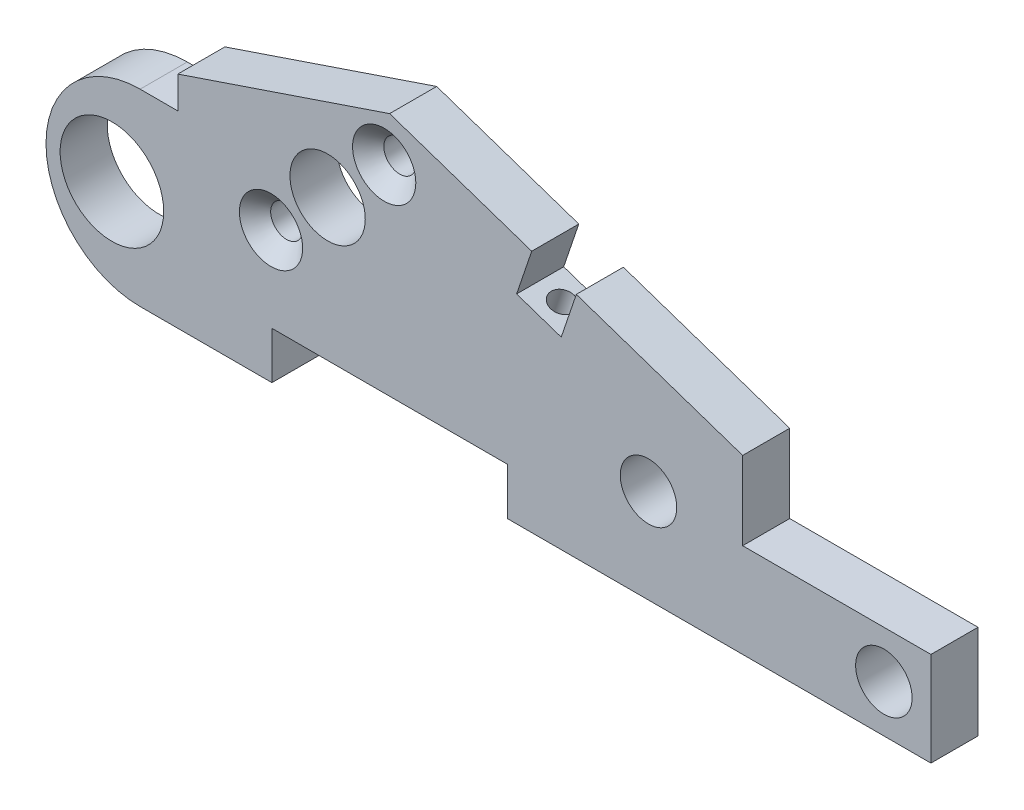
ISO-10303-21;
HEADER;
FILE_DESCRIPTION(('STEP AP214'),'2;1');
FILE_NAME('part.step','',(''),(''),'','','');
FILE_SCHEMA(('AUTOMOTIVE_DESIGN { 1 0 10303 214 1 1 1 1 }'));
ENDSEC;
DATA;
#1=APPLICATION_CONTEXT('core data for automotive mechanical design processes');
#2=APPLICATION_PROTOCOL_DEFINITION('international standard','automotive_design',2000,#1);
#3=PRODUCT_CONTEXT('',#1,'mechanical');
#4=PRODUCT('Part','Part','',(#3));
#5=PRODUCT_RELATED_PRODUCT_CATEGORY('part','',(#4));
#6=PRODUCT_DEFINITION_FORMATION('','',#4);
#7=PRODUCT_DEFINITION_CONTEXT('part definition',#1,'design');
#8=PRODUCT_DEFINITION('design','',#6,#7);
#9=PRODUCT_DEFINITION_SHAPE('','',#8);
#10=(LENGTH_UNIT() NAMED_UNIT(*) SI_UNIT(.MILLI.,.METRE.));
#11=(NAMED_UNIT(*) PLANE_ANGLE_UNIT() SI_UNIT($,.RADIAN.));
#12=(NAMED_UNIT(*) SI_UNIT($,.STERADIAN.) SOLID_ANGLE_UNIT());
#13=UNCERTAINTY_MEASURE_WITH_UNIT(LENGTH_MEASURE(1.E-05),#10,'distance_accuracy_value','');
#14=(GEOMETRIC_REPRESENTATION_CONTEXT(3) GLOBAL_UNCERTAINTY_ASSIGNED_CONTEXT((#13)) GLOBAL_UNIT_ASSIGNED_CONTEXT((#10,
#11,#12)) REPRESENTATION_CONTEXT('',''));
#15=CARTESIAN_POINT('',(0.,0.,0.));
#16=DIRECTION('',(0.,0.,1.));
#17=DIRECTION('',(1.,0.,0.));
#18=AXIS2_PLACEMENT_3D('',#15,#16,#17);
#19=CARTESIAN_POINT('',(42.6970003538652,5.72706700869806,5.));
#20=DIRECTION('',(-0.320596174316883,-0.947215969572609,0.));
#21=DIRECTION('',(0.94721596957261,-0.320596174316883,0.));
#22=AXIS2_PLACEMENT_3D('',#19,#20,#21);
#23=PLANE('',#22);
#24=DIRECTION('',(-0.947215969572609,0.320596174316883,0.));
#25=VECTOR('',#24,1.);
#26=CARTESIAN_POINT('',(42.6970003538652,5.72706700869806,0.));
#27=LINE('',#26,#25);
#28=CARTESIAN_POINT('',(42.6970003538652,5.72706700869806,0.));
#29=VERTEX_POINT('',#28);
#30=CARTESIAN_POINT('',(25.027600717769,11.7074791932229,0.));
#31=VERTEX_POINT('',#30);
#32=EDGE_CURVE('E316',#29,#31,#27,.T.);
#33=ORIENTED_EDGE('',*,*,#32,.T.);
#34=DIRECTION('',(0.,0.,-1.));
#35=VECTOR('',#34,1.);
#36=CARTESIAN_POINT('',(25.027600717769,11.7074791932229,10.));
#37=LINE('',#36,#35);
#38=CARTESIAN_POINT('',(25.027600717769,11.7074791932229,5.));
#39=VERTEX_POINT('',#38);
#40=EDGE_CURVE('E194',#39,#31,#37,.T.);
#41=ORIENTED_EDGE('',*,*,#40,.F.);
#42=DIRECTION('',(-0.947215969572609,0.320596174316883,0.));
#43=VECTOR('',#42,1.);
#44=CARTESIAN_POINT('',(42.6970003538652,5.72706700869806,5.));
#45=LINE('',#44,#43);
#46=CARTESIAN_POINT('',(42.6970003538652,5.72706700869806,5.));
#47=VERTEX_POINT('',#46);
#48=EDGE_CURVE('E295',#47,#39,#45,.T.);
#49=ORIENTED_EDGE('',*,*,#48,.F.);
#50=DIRECTION('',(0.,0.,-1.));
#51=VECTOR('',#50,1.);
#52=CARTESIAN_POINT('',(42.6970003538652,5.72706700869806,5.));
#53=LINE('',#52,#51);
#54=EDGE_CURVE('E331',#47,#29,#53,.T.);
#55=ORIENTED_EDGE('',*,*,#54,.T.);
#56=EDGE_LOOP('',(#33,#41,#49,#55));
#57=FACE_BOUND('',#56,.T.);
#58=ADVANCED_FACE('F36',(#57),#23,.F.);
#59=CARTESIAN_POINT('',(52.6970003538652,-12.5806252989942,5.));
#60=DIRECTION('',(0.,1.,0.));
#61=DIRECTION('',(0.,0.,1.));
#62=AXIS2_PLACEMENT_3D('',#59,#60,#61);
#63=PLANE('',#62);
#64=DIRECTION('',(1.,0.,0.));
#65=VECTOR('',#64,1.);
#66=CARTESIAN_POINT('',(-31.3029996461349,-12.5806252989942,5.));
#67=LINE('',#66,#65);
#68=CARTESIAN_POINT('',(17.6970003538651,-12.5806252989942,5.));
#69=VERTEX_POINT('',#68);
#70=CARTESIAN_POINT('',(62.6970003538652,-12.5806252989942,5.));
#71=VERTEX_POINT('',#70);
#72=EDGE_CURVE('E284',#69,#71,#67,.T.);
#73=ORIENTED_EDGE('',*,*,#72,.F.);
#74=DIRECTION('',(0.,0.,-1.));
#75=VECTOR('',#74,1.);
#76=CARTESIAN_POINT('',(17.6970003538651,-12.5806252989942,10.));
#77=LINE('',#76,#75);
#78=CARTESIAN_POINT('',(17.6970003538651,-12.5806252989942,0.));
#79=VERTEX_POINT('',#78);
#80=EDGE_CURVE('E253',#69,#79,#77,.T.);
#81=ORIENTED_EDGE('',*,*,#80,.T.);
#82=DIRECTION('',(1.,0.,0.));
#83=VECTOR('',#82,1.);
#84=CARTESIAN_POINT('',(52.6970003538652,-12.5806252989942,0.));
#85=LINE('',#84,#83);
#86=CARTESIAN_POINT('',(62.6970003538652,-12.5806252989942,0.));
#87=VERTEX_POINT('',#86);
#88=EDGE_CURVE('E305',#79,#87,#85,.T.);
#89=ORIENTED_EDGE('',*,*,#88,.T.);
#90=DIRECTION('',(0.,0.,-1.));
#91=VECTOR('',#90,1.);
#92=CARTESIAN_POINT('',(62.6970003538652,-12.5806252989942,5.));
#93=LINE('',#92,#91);
#94=EDGE_CURVE('E340',#71,#87,#93,.T.);
#95=ORIENTED_EDGE('',*,*,#94,.F.);
#96=EDGE_LOOP('',(#73,#81,#89,#95));
#97=FACE_BOUND('',#96,.T.);
#98=ADVANCED_FACE('F427',(#97),#63,.F.);
#99=CARTESIAN_POINT('',(-27.3029996461349,7.41937470100577,5.));
#100=DIRECTION('',(0.,-1.,0.));
#101=DIRECTION('',(1.,0.,0.));
#102=AXIS2_PLACEMENT_3D('',#99,#100,#101);
#103=PLANE('',#102);
#104=DIRECTION('',(-1.,0.,0.));
#105=VECTOR('',#104,1.);
#106=CARTESIAN_POINT('',(-27.3029996461349,7.41937470100577,0.));
#107=LINE('',#106,#105);
#108=CARTESIAN_POINT('',(-17.3029996461349,7.41937470100577,0.));
#109=VERTEX_POINT('',#108);
#110=CARTESIAN_POINT('',(-21.3029996461349,7.41937470100577,0.));
#111=VERTEX_POINT('',#110);
#112=EDGE_CURVE('E281',#109,#111,#107,.T.);
#113=ORIENTED_EDGE('',*,*,#112,.T.);
#114=DIRECTION('',(0.,0.,-1.));
#115=VECTOR('',#114,1.);
#116=CARTESIAN_POINT('',(-21.3029996461349,7.41937470100577,5.));
#117=LINE('',#116,#115);
#118=CARTESIAN_POINT('',(-21.3029996461349,7.41937470100577,5.));
#119=VERTEX_POINT('',#118);
#120=EDGE_CURVE('E11',#111,#119,#117,.F.);
#121=ORIENTED_EDGE('',*,*,#120,.T.);
#122=DIRECTION('',(-1.,0.,0.));
#123=VECTOR('',#122,1.);
#124=CARTESIAN_POINT('',(-27.3029996461349,7.41937470100577,5.));
#125=LINE('',#124,#123);
#126=CARTESIAN_POINT('',(-17.3029996461349,7.41937470100577,5.));
#127=VERTEX_POINT('',#126);
#128=EDGE_CURVE('E282',#127,#119,#125,.T.);
#129=ORIENTED_EDGE('',*,*,#128,.F.);
#130=DIRECTION('',(0.,0.,-1.));
#131=VECTOR('',#130,1.);
#132=CARTESIAN_POINT('',(-17.3029996461349,7.41937470100577,5.));
#133=LINE('',#132,#131);
#134=EDGE_CURVE('E302',#127,#109,#133,.T.);
#135=ORIENTED_EDGE('',*,*,#134,.T.);
#136=EDGE_LOOP('',(#113,#121,#129,#135));
#137=FACE_BOUND('',#136,.T.);
#138=ADVANCED_FACE('F374',(#137),#103,.F.);
#139=CARTESIAN_POINT('',(-21.3029996461349,-12.5806252989942,5.));
#140=VERTEX_POINT('',#139);
#141=CARTESIAN_POINT('',(-7.30299964613486,-12.5806252989942,5.));
#142=VERTEX_POINT('',#141);
#143=EDGE_CURVE('E286',#140,#142,#67,.T.);
#144=ORIENTED_EDGE('',*,*,#143,.F.);
#145=DIRECTION('',(0.,0.,-1.));
#146=VECTOR('',#145,1.);
#147=CARTESIAN_POINT('',(-21.3029996461349,-12.5806252989942,5.));
#148=LINE('',#147,#146);
#149=CARTESIAN_POINT('',(-21.3029996461349,-12.5806252989942,0.));
#150=VERTEX_POINT('',#149);
#151=EDGE_CURVE('E343',#140,#150,#148,.T.);
#152=ORIENTED_EDGE('',*,*,#151,.T.);
#153=CARTESIAN_POINT('',(-7.30299964613486,-12.5806252989942,0.));
#154=VERTEX_POINT('',#153);
#155=EDGE_CURVE('E306',#150,#154,#85,.T.);
#156=ORIENTED_EDGE('',*,*,#155,.T.);
#157=DIRECTION('',(0.,0.,-1.));
#158=VECTOR('',#157,1.);
#159=CARTESIAN_POINT('',(-7.30299964613486,-12.5806252989942,10.));
#160=LINE('',#159,#158);
#161=EDGE_CURVE('E252',#142,#154,#160,.T.);
#162=ORIENTED_EDGE('',*,*,#161,.F.);
#163=EDGE_LOOP('',(#144,#152,#156,#162));
#164=FACE_BOUND('',#163,.T.);
#165=ADVANCED_FACE('F362',(#164),#63,.F.);
#166=CARTESIAN_POINT('',(62.6970003538652,-12.5806252989942,5.));
#167=DIRECTION('',(-1.,0.,0.));
#168=DIRECTION('',(0.,0.,1.));
#169=AXIS2_PLACEMENT_3D('',#166,#167,#168);
#170=PLANE('',#169);
#171=DIRECTION('',(0.,1.,0.));
#172=VECTOR('',#171,1.);
#173=CARTESIAN_POINT('',(62.6970003538652,-12.5806252989942,0.));
#174=LINE('',#173,#172);
#175=CARTESIAN_POINT('',(62.6970003538652,-2.58062529899422,0.));
#176=VERTEX_POINT('',#175);
#177=EDGE_CURVE('E308',#87,#176,#174,.T.);
#178=ORIENTED_EDGE('',*,*,#177,.T.);
#179=DIRECTION('',(0.,0.,-1.));
#180=VECTOR('',#179,1.);
#181=CARTESIAN_POINT('',(62.6970003538652,-2.58062529899422,5.));
#182=LINE('',#181,#180);
#183=CARTESIAN_POINT('',(62.6970003538652,-2.58062529899422,5.));
#184=VERTEX_POINT('',#183);
#185=EDGE_CURVE('E337',#184,#176,#182,.T.);
#186=ORIENTED_EDGE('',*,*,#185,.F.);
#187=DIRECTION('',(0.,1.,0.));
#188=VECTOR('',#187,1.);
#189=CARTESIAN_POINT('',(62.6970003538652,-12.5806252989942,5.));
#190=LINE('',#189,#188);
#191=EDGE_CURVE('E288',#71,#184,#190,.T.);
#192=ORIENTED_EDGE('',*,*,#191,.F.);
#193=ORIENTED_EDGE('',*,*,#94,.T.);
#194=EDGE_LOOP('',(#178,#186,#192,#193));
#195=FACE_BOUND('',#194,.T.);
#196=ADVANCED_FACE('F414',(#195),#170,.F.);
#197=CARTESIAN_POINT('',(52.6970003538652,-2.58062529899422,5.));
#198=DIRECTION('',(0.,-1.,0.));
#199=DIRECTION('',(1.,0.,0.));
#200=AXIS2_PLACEMENT_3D('',#197,#198,#199);
#201=PLANE('',#200);
#202=DIRECTION('',(-1.,0.,0.));
#203=VECTOR('',#202,1.);
#204=CARTESIAN_POINT('',(52.6970003538652,-2.58062529899422,0.));
#205=LINE('',#204,#203);
#206=CARTESIAN_POINT('',(42.6970003538652,-2.58062529899422,0.));
#207=VERTEX_POINT('',#206);
#208=EDGE_CURVE('E311',#176,#207,#205,.T.);
#209=ORIENTED_EDGE('',*,*,#208,.T.);
#210=DIRECTION('',(0.,0.,-1.));
#211=VECTOR('',#210,1.);
#212=CARTESIAN_POINT('',(42.6970003538652,-2.58062529899422,5.));
#213=LINE('',#212,#211);
#214=CARTESIAN_POINT('',(42.6970003538652,-2.58062529899422,5.));
#215=VERTEX_POINT('',#214);
#216=EDGE_CURVE('E334',#215,#207,#213,.T.);
#217=ORIENTED_EDGE('',*,*,#216,.F.);
#218=DIRECTION('',(-1.,0.,0.));
#219=VECTOR('',#218,1.);
#220=CARTESIAN_POINT('',(62.6970003538652,-2.58062529899422,5.));
#221=LINE('',#220,#219);
#222=EDGE_CURVE('E290',#184,#215,#221,.T.);
#223=ORIENTED_EDGE('',*,*,#222,.F.);
#224=ORIENTED_EDGE('',*,*,#185,.T.);
#225=EDGE_LOOP('',(#209,#217,#223,#224));
#226=FACE_BOUND('',#225,.T.);
#227=ADVANCED_FACE('F417',(#226),#201,.F.);
#228=CARTESIAN_POINT('',(42.6970003538652,-2.58062529899422,5.));
#229=DIRECTION('',(-1.,0.,0.));
#230=DIRECTION('',(0.,0.,1.));
#231=AXIS2_PLACEMENT_3D('',#228,#229,#230);
#232=PLANE('',#231);
#233=DIRECTION('',(0.,1.,0.));
#234=VECTOR('',#233,1.);
#235=CARTESIAN_POINT('',(42.6970003538652,-2.58062529899422,0.));
#236=LINE('',#235,#234);
#237=EDGE_CURVE('E313',#207,#29,#236,.T.);
#238=ORIENTED_EDGE('',*,*,#237,.T.);
#239=ORIENTED_EDGE('',*,*,#54,.F.);
#240=DIRECTION('',(0.,1.,0.));
#241=VECTOR('',#240,1.);
#242=CARTESIAN_POINT('',(42.6970003538652,-2.58062529899422,5.));
#243=LINE('',#242,#241);
#244=EDGE_CURVE('E292',#215,#47,#243,.T.);
#245=ORIENTED_EDGE('',*,*,#244,.F.);
#246=ORIENTED_EDGE('',*,*,#216,.T.);
#247=EDGE_LOOP('',(#238,#239,#245,#246));
#248=FACE_BOUND('',#247,.T.);
#249=ADVANCED_FACE('F407',(#248),#232,.F.);
#250=CARTESIAN_POINT('',(20.2915208699059,13.3104600648074,5.));
#251=VERTEX_POINT('',#250);
#252=CARTESIAN_POINT('',(5.19700035386514,18.4193747010058,5.));
#253=VERTEX_POINT('',#252);
#254=EDGE_CURVE('E294',#251,#253,#45,.T.);
#255=ORIENTED_EDGE('',*,*,#254,.F.);
#256=DIRECTION('',(0.,0.,-1.));
#257=VECTOR('',#256,1.);
#258=CARTESIAN_POINT('',(20.2915208699059,13.3104600648074,10.));
#259=LINE('',#258,#257);
#260=CARTESIAN_POINT('',(20.2915208699059,13.3104600648074,0.));
#261=VERTEX_POINT('',#260);
#262=EDGE_CURVE('E197',#251,#261,#259,.T.);
#263=ORIENTED_EDGE('',*,*,#262,.T.);
#264=CARTESIAN_POINT('',(5.19700035386514,18.4193747010058,0.));
#265=VERTEX_POINT('',#264);
#266=EDGE_CURVE('E315',#261,#265,#27,.T.);
#267=ORIENTED_EDGE('',*,*,#266,.T.);
#268=DIRECTION('',(0.,0.,-1.));
#269=VECTOR('',#268,1.);
#270=CARTESIAN_POINT('',(5.19700035386514,18.4193747010058,5.));
#271=LINE('',#270,#269);
#272=EDGE_CURVE('E328',#253,#265,#271,.T.);
#273=ORIENTED_EDGE('',*,*,#272,.F.);
#274=EDGE_LOOP('',(#255,#263,#267,#273));
#275=FACE_BOUND('',#274,.T.);
#276=ADVANCED_FACE('F390',(#275),#23,.F.);
#277=CARTESIAN_POINT('',(-17.3029996461349,10.8091054247652,5.));
#278=DIRECTION('',(0.320402940151015,-0.947281349939175,0.));
#279=DIRECTION('',(0.947281349939175,0.320402940151015,0.));
#280=AXIS2_PLACEMENT_3D('',#277,#278,#279);
#281=PLANE('',#280);
#282=DIRECTION('',(-0.947281349939175,-0.320402940151015,0.));
#283=VECTOR('',#282,1.);
#284=CARTESIAN_POINT('',(-17.3029996461349,10.8091054247652,0.));
#285=LINE('',#284,#283);
#286=CARTESIAN_POINT('',(-17.3029996461349,10.8091054247652,0.));
#287=VERTEX_POINT('',#286);
#288=EDGE_CURVE('E319',#265,#287,#285,.T.);
#289=ORIENTED_EDGE('',*,*,#288,.T.);
#290=DIRECTION('',(0.,0.,-1.));
#291=VECTOR('',#290,1.);
#292=CARTESIAN_POINT('',(-17.3029996461349,10.8091054247652,5.));
#293=LINE('',#292,#291);
#294=CARTESIAN_POINT('',(-17.3029996461349,10.8091054247652,5.));
#295=VERTEX_POINT('',#294);
#296=EDGE_CURVE('E325',#295,#287,#293,.T.);
#297=ORIENTED_EDGE('',*,*,#296,.F.);
#298=DIRECTION('',(-0.947281349939175,-0.320402940151015,0.));
#299=VECTOR('',#298,1.);
#300=CARTESIAN_POINT('',(-17.3029996461349,10.8091054247652,5.));
#301=LINE('',#300,#299);
#302=EDGE_CURVE('E298',#253,#295,#301,.T.);
#303=ORIENTED_EDGE('',*,*,#302,.F.);
#304=ORIENTED_EDGE('',*,*,#272,.T.);
#305=EDGE_LOOP('',(#289,#297,#303,#304));
#306=FACE_BOUND('',#305,.T.);
#307=ADVANCED_FACE('F386',(#306),#281,.F.);
#308=CARTESIAN_POINT('',(-17.3029996461349,7.41937470100577,5.));
#309=DIRECTION('',(1.,0.,0.));
#310=DIRECTION('',(0.,1.,0.));
#311=AXIS2_PLACEMENT_3D('',#308,#309,#310);
#312=PLANE('',#311);
#313=DIRECTION('',(0.,-1.,0.));
#314=VECTOR('',#313,1.);
#315=CARTESIAN_POINT('',(-17.3029996461349,7.41937470100577,0.));
#316=LINE('',#315,#314);
#317=EDGE_CURVE('E285',#287,#109,#316,.T.);
#318=ORIENTED_EDGE('',*,*,#317,.T.);
#319=ORIENTED_EDGE('',*,*,#134,.F.);
#320=DIRECTION('',(0.,-1.,0.));
#321=VECTOR('',#320,1.);
#322=CARTESIAN_POINT('',(-17.3029996461349,7.41937470100577,5.));
#323=LINE('',#322,#321);
#324=EDGE_CURVE('E300',#295,#127,#323,.T.);
#325=ORIENTED_EDGE('',*,*,#324,.F.);
#326=ORIENTED_EDGE('',*,*,#296,.T.);
#327=EDGE_LOOP('',(#318,#319,#325,#326));
#328=FACE_BOUND('',#327,.T.);
#329=ADVANCED_FACE('F380',(#328),#312,.F.);
#330=CARTESIAN_POINT('',(0.,0.,5.));
#331=DIRECTION('',(0.,0.,1.));
#332=DIRECTION('',(1.,0.,0.));
#333=AXIS2_PLACEMENT_3D('',#330,#331,#332);
#334=PLANE('',#333);
#335=CARTESIAN_POINT('',(57.6970003538652,-7.58062529899422,5.));
#336=DIRECTION('',(0.,0.,1.));
#337=DIRECTION('',(1.,0.,0.));
#338=AXIS2_PLACEMENT_3D('',#335,#336,#337);
#339=CIRCLE('',#338,2.99999999999999);
#340=CARTESIAN_POINT('',(60.6970003538652,-7.58062529899422,5.));
#341=VERTEX_POINT('',#340);
#342=EDGE_CURVE('E185',#341,#341,#339,.T.);
#343=ORIENTED_EDGE('',*,*,#342,.F.);
#344=EDGE_LOOP('',(#343));
#345=FACE_BOUND('',#344,.T.);
#346=DIRECTION('',(0.320596174316883,0.94721596957261,0.));
#347=VECTOR('',#346,1.);
#348=CARTESIAN_POINT('',(18.8999613052166,-6.39690998022717,5.));
#349=LINE('',#348,#347);
#350=CARTESIAN_POINT('',(23.4246198461846,6.97139934535989,5.));
#351=VERTEX_POINT('',#350);
#352=EDGE_CURVE('E206',#351,#39,#349,.T.);
#353=ORIENTED_EDGE('',*,*,#352,.F.);
#354=DIRECTION('',(0.947215969572609,-0.320596174316884,0.));
#355=VECTOR('',#354,1.);
#356=CARTESIAN_POINT('',(4.52465854096794,13.3683093255871,5.));
#357=LINE('',#356,#355);
#358=CARTESIAN_POINT('',(18.6885399983215,8.57438021694431,5.));
#359=VERTEX_POINT('',#358);
#360=EDGE_CURVE('E196',#359,#351,#357,.T.);
#361=ORIENTED_EDGE('',*,*,#360,.F.);
#362=DIRECTION('',(-0.320596174316883,-0.94721596957261,0.));
#363=VECTOR('',#362,1.);
#364=CARTESIAN_POINT('',(14.1638814573536,-4.79392910864275,5.));
#365=LINE('',#364,#363);
#366=EDGE_CURVE('E204',#251,#359,#365,.T.);
#367=ORIENTED_EDGE('',*,*,#366,.F.);
#368=ORIENTED_EDGE('',*,*,#254,.T.);
#369=ORIENTED_EDGE('',*,*,#302,.T.);
#370=ORIENTED_EDGE('',*,*,#324,.T.);
#371=ORIENTED_EDGE('',*,*,#128,.T.);
#372=CARTESIAN_POINT('',(-21.3029996461349,-2.58062529899422,5.));
#373=DIRECTION('',(0.,0.,1.));
#374=DIRECTION('',(1.,0.,0.));
#375=AXIS2_PLACEMENT_3D('',#372,#373,#374);
#376=CIRCLE('',#375,10.);
#377=CARTESIAN_POINT('',(-31.3029996461349,-2.58062529899422,5.));
#378=VERTEX_POINT('',#377);
#379=EDGE_CURVE('E60',#119,#378,#376,.T.);
#380=ORIENTED_EDGE('',*,*,#379,.T.);
#381=CARTESIAN_POINT('',(-21.3029996461349,-2.58062529899422,5.));
#382=DIRECTION('',(0.,0.,1.));
#383=DIRECTION('',(1.,0.,0.));
#384=AXIS2_PLACEMENT_3D('',#381,#382,#383);
#385=CIRCLE('',#384,10.);
#386=EDGE_CURVE('E45',#378,#140,#385,.T.);
#387=ORIENTED_EDGE('',*,*,#386,.T.);
#388=ORIENTED_EDGE('',*,*,#143,.T.);
#389=DIRECTION('',(0.,-1.,0.));
#390=VECTOR('',#389,1.);
#391=CARTESIAN_POINT('',(-7.30299964613486,0.,5.));
#392=LINE('',#391,#390);
#393=CARTESIAN_POINT('',(-7.30299964613486,-7.58062529899423,5.));
#394=VERTEX_POINT('',#393);
#395=EDGE_CURVE('E256',#394,#142,#392,.T.);
#396=ORIENTED_EDGE('',*,*,#395,.F.);
#397=DIRECTION('',(-1.,0.,0.));
#398=VECTOR('',#397,1.);
#399=CARTESIAN_POINT('',(0.,-7.58062529899423,5.));
#400=LINE('',#399,#398);
#401=CARTESIAN_POINT('',(17.6970003538651,-7.58062529899423,5.));
#402=VERTEX_POINT('',#401);
#403=EDGE_CURVE('E265',#402,#394,#400,.T.);
#404=ORIENTED_EDGE('',*,*,#403,.F.);
#405=DIRECTION('',(0.,1.,0.));
#406=VECTOR('',#405,1.);
#407=CARTESIAN_POINT('',(17.6970003538651,0.,5.));
#408=LINE('',#407,#406);
#409=EDGE_CURVE('E267',#69,#402,#408,.T.);
#410=ORIENTED_EDGE('',*,*,#409,.F.);
#411=ORIENTED_EDGE('',*,*,#72,.T.);
#412=ORIENTED_EDGE('',*,*,#191,.T.);
#413=ORIENTED_EDGE('',*,*,#222,.T.);
#414=ORIENTED_EDGE('',*,*,#244,.T.);
#415=ORIENTED_EDGE('',*,*,#48,.T.);
#416=EDGE_LOOP('',(#353,#361,#367,#368,#369,#370,#371,#380,#387,#388,#396,#404,#410,#411,#412,
#413,#414,#415));
#417=FACE_BOUND('',#416,.T.);
#418=CARTESIAN_POINT('',(-7.40052881144131,1.4089670609201,5.));
#419=DIRECTION('',(0.,0.,1.));
#420=DIRECTION('',(1.,0.,0.));
#421=AXIS2_PLACEMENT_3D('',#418,#419,#420);
#422=CIRCLE('',#421,3.36);
#423=CARTESIAN_POINT('',(-4.04052881144131,1.4089670609201,5.));
#424=VERTEX_POINT('',#423);
#425=EDGE_CURVE('E220',#424,#424,#422,.T.);
#426=ORIENTED_EDGE('',*,*,#425,.F.);
#427=EDGE_LOOP('',(#426));
#428=FACE_BOUND('',#427,.T.);
#429=CARTESIAN_POINT('',(4.62028646873,13.4297823410914,5.));
#430=DIRECTION('',(0.,0.,1.));
#431=DIRECTION('',(1.,0.,0.));
#432=AXIS2_PLACEMENT_3D('',#429,#430,#431);
#433=CIRCLE('',#432,3.36);
#434=CARTESIAN_POINT('',(7.98028646873,13.4297823410914,5.));
#435=VERTEX_POINT('',#434);
#436=EDGE_CURVE('E229',#435,#435,#433,.T.);
#437=ORIENTED_EDGE('',*,*,#436,.F.);
#438=EDGE_LOOP('',(#437));
#439=FACE_BOUND('',#438,.T.);
#440=CARTESIAN_POINT('',(-1.39012117135565,7.41937470100576,5.));
#441=DIRECTION('',(0.,0.,1.));
#442=DIRECTION('',(1.,0.,0.));
#443=AXIS2_PLACEMENT_3D('',#440,#441,#442);
#444=CIRCLE('',#443,4.);
#445=CARTESIAN_POINT('',(2.60987882864434,7.41937470100576,5.));
#446=VERTEX_POINT('',#445);
#447=EDGE_CURVE('E238',#446,#446,#444,.T.);
#448=ORIENTED_EDGE('',*,*,#447,.F.);
#449=EDGE_LOOP('',(#448));
#450=FACE_BOUND('',#449,.T.);
#451=CARTESIAN_POINT('',(32.6970003538651,-2.58062529899423,5.));
#452=DIRECTION('',(0.,0.,1.));
#453=DIRECTION('',(1.,0.,0.));
#454=AXIS2_PLACEMENT_3D('',#451,#452,#453);
#455=CIRCLE('',#454,3.);
#456=CARTESIAN_POINT('',(35.6970003538651,-2.58062529899423,5.));
#457=VERTEX_POINT('',#456);
#458=EDGE_CURVE('E269',#457,#457,#455,.T.);
#459=ORIENTED_EDGE('',*,*,#458,.F.);
#460=EDGE_LOOP('',(#459));
#461=FACE_BOUND('',#460,.T.);
#462=CARTESIAN_POINT('',(-24.3029996461349,-2.58062529899424,5.));
#463=DIRECTION('',(0.,0.,1.));
#464=DIRECTION('',(1.,0.,0.));
#465=AXIS2_PLACEMENT_3D('',#462,#463,#464);
#466=CIRCLE('',#465,5.5);
#467=CARTESIAN_POINT('',(-18.8029996461349,-2.58062529899424,5.));
#468=VERTEX_POINT('',#467);
#469=EDGE_CURVE('E275',#468,#468,#466,.T.);
#470=ORIENTED_EDGE('',*,*,#469,.F.);
#471=EDGE_LOOP('',(#470));
#472=FACE_BOUND('',#471,.T.);
#473=ADVANCED_FACE('F354',(#345,#417,#428,#439,#450,#461,#472),#334,.T.);
#474=CARTESIAN_POINT('',(0.,0.,0.));
#475=DIRECTION('',(0.,0.,1.));
#476=DIRECTION('',(1.,0.,0.));
#477=AXIS2_PLACEMENT_3D('',#474,#475,#476);
#478=PLANE('',#477);
#479=CARTESIAN_POINT('',(57.6970003538652,-7.58062529899422,0.));
#480=DIRECTION('',(0.,0.,-1.));
#481=DIRECTION('',(-1.,0.,0.));
#482=AXIS2_PLACEMENT_3D('',#479,#480,#481);
#483=CIRCLE('',#482,2.99999999999999);
#484=CARTESIAN_POINT('',(54.6970003538652,-7.58062529899422,0.));
#485=VERTEX_POINT('',#484);
#486=EDGE_CURVE('E525',#485,#485,#483,.T.);
#487=ORIENTED_EDGE('',*,*,#486,.F.);
#488=EDGE_LOOP('',(#487));
#489=FACE_BOUND('',#488,.T.);
#490=CARTESIAN_POINT('',(-7.40052881144131,1.4089670609201,0.));
#491=DIRECTION('',(0.,0.,1.));
#492=DIRECTION('',(1.,0.,0.));
#493=AXIS2_PLACEMENT_3D('',#490,#491,#492);
#494=CIRCLE('',#493,1.7);
#495=CARTESIAN_POINT('',(-5.70052881144131,1.4089670609201,0.));
#496=VERTEX_POINT('',#495);
#497=EDGE_CURVE('E226',#496,#496,#494,.T.);
#498=ORIENTED_EDGE('',*,*,#497,.T.);
#499=EDGE_LOOP('',(#498));
#500=FACE_BOUND('',#499,.T.);
#501=CARTESIAN_POINT('',(4.62028646873,13.4297823410914,0.));
#502=DIRECTION('',(0.,0.,1.));
#503=DIRECTION('',(1.,0.,0.));
#504=AXIS2_PLACEMENT_3D('',#501,#502,#503);
#505=CIRCLE('',#504,1.7);
#506=CARTESIAN_POINT('',(6.32028646873,13.4297823410914,0.));
#507=VERTEX_POINT('',#506);
#508=EDGE_CURVE('E235',#507,#507,#505,.T.);
#509=ORIENTED_EDGE('',*,*,#508,.T.);
#510=EDGE_LOOP('',(#509));
#511=FACE_BOUND('',#510,.T.);
#512=CARTESIAN_POINT('',(-1.39012117135565,7.41937470100576,0.));
#513=DIRECTION('',(0.,0.,1.));
#514=DIRECTION('',(1.,0.,0.));
#515=AXIS2_PLACEMENT_3D('',#512,#513,#514);
#516=CIRCLE('',#515,4.);
#517=CARTESIAN_POINT('',(2.60987882864434,7.41937470100576,0.));
#518=VERTEX_POINT('',#517);
#519=EDGE_CURVE('E241',#518,#518,#516,.T.);
#520=ORIENTED_EDGE('',*,*,#519,.T.);
#521=EDGE_LOOP('',(#520));
#522=FACE_BOUND('',#521,.T.);
#523=CARTESIAN_POINT('',(32.6970003538651,-2.58062529899423,0.));
#524=DIRECTION('',(0.,0.,1.));
#525=DIRECTION('',(1.,0.,0.));
#526=AXIS2_PLACEMENT_3D('',#523,#524,#525);
#527=CIRCLE('',#526,3.);
#528=CARTESIAN_POINT('',(35.6970003538651,-2.58062529899423,0.));
#529=VERTEX_POINT('',#528);
#530=EDGE_CURVE('E272',#529,#529,#527,.T.);
#531=ORIENTED_EDGE('',*,*,#530,.T.);
#532=EDGE_LOOP('',(#531));
#533=FACE_BOUND('',#532,.T.);
#534=CARTESIAN_POINT('',(-24.3029996461349,-2.58062529899424,0.));
#535=DIRECTION('',(0.,0.,1.));
#536=DIRECTION('',(1.,0.,0.));
#537=AXIS2_PLACEMENT_3D('',#534,#535,#536);
#538=CIRCLE('',#537,5.5);
#539=CARTESIAN_POINT('',(-18.8029996461349,-2.58062529899424,0.));
#540=VERTEX_POINT('',#539);
#541=EDGE_CURVE('E278',#540,#540,#538,.T.);
#542=ORIENTED_EDGE('',*,*,#541,.T.);
#543=EDGE_LOOP('',(#542));
#544=FACE_BOUND('',#543,.T.);
#545=DIRECTION('',(-0.947215969572609,0.320596174316884,0.));
#546=VECTOR('',#545,1.);
#547=CARTESIAN_POINT('',(23.4246198461846,6.97139934535989,0.));
#548=LINE('',#547,#546);
#549=CARTESIAN_POINT('',(23.4246198461846,6.97139934535989,0.));
#550=VERTEX_POINT('',#549);
#551=CARTESIAN_POINT('',(18.6885399983215,8.57438021694431,0.));
#552=VERTEX_POINT('',#551);
#553=EDGE_CURVE('E182',#550,#552,#548,.T.);
#554=ORIENTED_EDGE('',*,*,#553,.F.);
#555=DIRECTION('',(-0.320596174316883,-0.947215969572609,0.));
#556=VECTOR('',#555,1.);
#557=CARTESIAN_POINT('',(25.027600717769,11.7074791932229,0.));
#558=LINE('',#557,#556);
#559=EDGE_CURVE('E52',#31,#550,#558,.T.);
#560=ORIENTED_EDGE('',*,*,#559,.F.);
#561=ORIENTED_EDGE('',*,*,#32,.F.);
#562=ORIENTED_EDGE('',*,*,#237,.F.);
#563=ORIENTED_EDGE('',*,*,#208,.F.);
#564=ORIENTED_EDGE('',*,*,#177,.F.);
#565=ORIENTED_EDGE('',*,*,#88,.F.);
#566=DIRECTION('',(0.,-1.,0.));
#567=VECTOR('',#566,1.);
#568=CARTESIAN_POINT('',(17.6970003538651,-12.5806252989942,0.));
#569=LINE('',#568,#567);
#570=CARTESIAN_POINT('',(17.6970003538651,-7.58062529899423,0.));
#571=VERTEX_POINT('',#570);
#572=EDGE_CURVE('E250',#571,#79,#569,.T.);
#573=ORIENTED_EDGE('',*,*,#572,.F.);
#574=DIRECTION('',(1.,0.,0.));
#575=VECTOR('',#574,1.);
#576=CARTESIAN_POINT('',(17.6970003538651,-7.58062529899423,0.));
#577=LINE('',#576,#575);
#578=CARTESIAN_POINT('',(-7.30299964613486,-7.58062529899423,0.));
#579=VERTEX_POINT('',#578);
#580=EDGE_CURVE('E247',#579,#571,#577,.T.);
#581=ORIENTED_EDGE('',*,*,#580,.F.);
#582=DIRECTION('',(0.,1.,0.));
#583=VECTOR('',#582,1.);
#584=CARTESIAN_POINT('',(-7.30299964613486,-7.58062529899423,0.));
#585=LINE('',#584,#583);
#586=EDGE_CURVE('E244',#154,#579,#585,.T.);
#587=ORIENTED_EDGE('',*,*,#586,.F.);
#588=ORIENTED_EDGE('',*,*,#155,.F.);
#589=CARTESIAN_POINT('',(-21.3029996461349,-2.58062529899422,0.));
#590=DIRECTION('',(0.,0.,1.));
#591=DIRECTION('',(1.,0.,0.));
#592=AXIS2_PLACEMENT_3D('',#589,#590,#591);
#593=CIRCLE('',#592,10.);
#594=CARTESIAN_POINT('',(-31.3029996461349,-2.58062529899422,0.));
#595=VERTEX_POINT('',#594);
#596=EDGE_CURVE('E348',#150,#595,#593,.F.);
#597=ORIENTED_EDGE('',*,*,#596,.T.);
#598=CARTESIAN_POINT('',(-21.3029996461349,-2.58062529899422,0.));
#599=DIRECTION('',(0.,0.,1.));
#600=DIRECTION('',(1.,0.,0.));
#601=AXIS2_PLACEMENT_3D('',#598,#599,#600);
#602=CIRCLE('',#601,10.);
#603=EDGE_CURVE('E346',#595,#111,#602,.F.);
#604=ORIENTED_EDGE('',*,*,#603,.T.);
#605=ORIENTED_EDGE('',*,*,#112,.F.);
#606=ORIENTED_EDGE('',*,*,#317,.F.);
#607=ORIENTED_EDGE('',*,*,#288,.F.);
#608=ORIENTED_EDGE('',*,*,#266,.F.);
#609=DIRECTION('',(0.320596174316883,0.947215969572609,0.));
#610=VECTOR('',#609,1.);
#611=CARTESIAN_POINT('',(18.6885399983215,8.57438021694431,0.));
#612=LINE('',#611,#610);
#613=EDGE_CURVE('E191',#552,#261,#612,.T.);
#614=ORIENTED_EDGE('',*,*,#613,.F.);
#615=EDGE_LOOP('',(#554,#560,#561,#562,#563,#564,#565,#573,#581,#587,#588,#597,#604,#605,#606,
#607,#608,#614));
#616=FACE_BOUND('',#615,.T.);
#617=ADVANCED_FACE('F368',(#489,#500,#511,#522,#533,#544,#616),#478,.F.);
#618=CARTESIAN_POINT('',(-24.3029996461349,-2.58062529899424,5.));
#619=DIRECTION('',(0.,0.,1.));
#620=DIRECTION('',(1.,0.,0.));
#621=AXIS2_PLACEMENT_3D('',#618,#619,#620);
#622=CYLINDRICAL_SURFACE('',#621,5.5);
#623=ORIENTED_EDGE('',*,*,#469,.T.);
#624=EDGE_LOOP('',(#623));
#625=FACE_BOUND('',#624,.T.);
#626=ORIENTED_EDGE('',*,*,#541,.F.);
#627=EDGE_LOOP('',(#626));
#628=FACE_BOUND('',#627,.T.);
#629=ADVANCED_FACE('F446',(#625,#628),#622,.F.);
#630=CARTESIAN_POINT('',(32.6970003538651,-2.58062529899423,5.));
#631=DIRECTION('',(0.,0.,1.));
#632=DIRECTION('',(1.,0.,0.));
#633=AXIS2_PLACEMENT_3D('',#630,#631,#632);
#634=CYLINDRICAL_SURFACE('',#633,3.);
#635=ORIENTED_EDGE('',*,*,#458,.T.);
#636=EDGE_LOOP('',(#635));
#637=FACE_BOUND('',#636,.T.);
#638=ORIENTED_EDGE('',*,*,#530,.F.);
#639=EDGE_LOOP('',(#638));
#640=FACE_BOUND('',#639,.T.);
#641=ADVANCED_FACE('F453',(#637,#640),#634,.F.);
#642=CARTESIAN_POINT('',(17.6970003538651,-12.5806252989942,10.));
#643=DIRECTION('',(1.,0.,0.));
#644=DIRECTION('',(0.,0.,-1.));
#645=AXIS2_PLACEMENT_3D('',#642,#643,#644);
#646=PLANE('',#645);
#647=ORIENTED_EDGE('',*,*,#409,.T.);
#648=DIRECTION('',(0.,0.,-1.));
#649=VECTOR('',#648,1.);
#650=CARTESIAN_POINT('',(17.6970003538651,-7.58062529899423,10.));
#651=LINE('',#650,#649);
#652=EDGE_CURVE('E257',#402,#571,#651,.T.);
#653=ORIENTED_EDGE('',*,*,#652,.T.);
#654=ORIENTED_EDGE('',*,*,#572,.T.);
#655=ORIENTED_EDGE('',*,*,#80,.F.);
#656=EDGE_LOOP('',(#647,#653,#654,#655));
#657=FACE_BOUND('',#656,.T.);
#658=ADVANCED_FACE('F457',(#657),#646,.F.);
#659=CARTESIAN_POINT('',(17.6970003538651,-7.58062529899423,10.));
#660=DIRECTION('',(0.,1.,0.));
#661=DIRECTION('',(-1.,0.,0.));
#662=AXIS2_PLACEMENT_3D('',#659,#660,#661);
#663=PLANE('',#662);
#664=CARTESIAN_POINT('',(-1.05299964613486,-7.58062529899423,2.5));
#665=DIRECTION('',(0.,-1.,0.));
#666=DIRECTION('',(0.,0.,-1.));
#667=AXIS2_PLACEMENT_3D('',#664,#665,#666);
#668=CIRCLE('',#667,1.25);
#669=CARTESIAN_POINT('',(-1.05299964613486,-7.58062529899423,1.25000000000001));
#670=VERTEX_POINT('',#669);
#671=EDGE_CURVE('E208',#670,#670,#668,.T.);
#672=ORIENTED_EDGE('',*,*,#671,.F.);
#673=EDGE_LOOP('',(#672));
#674=FACE_BOUND('',#673,.T.);
#675=CARTESIAN_POINT('',(11.4470003538651,-7.58062529899423,2.5));
#676=DIRECTION('',(0.,-1.,0.));
#677=DIRECTION('',(0.,0.,-1.));
#678=AXIS2_PLACEMENT_3D('',#675,#676,#677);
#679=CIRCLE('',#678,1.25);
#680=CARTESIAN_POINT('',(11.4470003538651,-7.58062529899423,1.25));
#681=VERTEX_POINT('',#680);
#682=EDGE_CURVE('E214',#681,#681,#679,.T.);
#683=ORIENTED_EDGE('',*,*,#682,.F.);
#684=EDGE_LOOP('',(#683));
#685=FACE_BOUND('',#684,.T.);
#686=ORIENTED_EDGE('',*,*,#403,.T.);
#687=DIRECTION('',(0.,0.,-1.));
#688=VECTOR('',#687,1.);
#689=CARTESIAN_POINT('',(-7.30299964613486,-7.58062529899423,10.));
#690=LINE('',#689,#688);
#691=EDGE_CURVE('E259',#394,#579,#690,.T.);
#692=ORIENTED_EDGE('',*,*,#691,.T.);
#693=ORIENTED_EDGE('',*,*,#580,.T.);
#694=ORIENTED_EDGE('',*,*,#652,.F.);
#695=EDGE_LOOP('',(#686,#692,#693,#694));
#696=FACE_BOUND('',#695,.T.);
#697=ADVANCED_FACE('F463',(#674,#685,#696),#663,.F.);
#698=CARTESIAN_POINT('',(-7.30299964613486,-7.58062529899423,10.));
#699=DIRECTION('',(-1.,0.,0.));
#700=DIRECTION('',(0.,0.,1.));
#701=AXIS2_PLACEMENT_3D('',#698,#699,#700);
#702=PLANE('',#701);
#703=ORIENTED_EDGE('',*,*,#395,.T.);
#704=ORIENTED_EDGE('',*,*,#161,.T.);
#705=ORIENTED_EDGE('',*,*,#586,.T.);
#706=ORIENTED_EDGE('',*,*,#691,.F.);
#707=EDGE_LOOP('',(#703,#704,#705,#706));
#708=FACE_BOUND('',#707,.T.);
#709=ADVANCED_FACE('F459',(#708),#702,.F.);
#710=CARTESIAN_POINT('',(-1.39012117135565,7.41937470100576,5.));
#711=DIRECTION('',(0.,0.,1.));
#712=DIRECTION('',(1.,0.,0.));
#713=AXIS2_PLACEMENT_3D('',#710,#711,#712);
#714=CYLINDRICAL_SURFACE('',#713,4.);
#715=ORIENTED_EDGE('',*,*,#447,.T.);
#716=EDGE_LOOP('',(#715));
#717=FACE_BOUND('',#716,.T.);
#718=ORIENTED_EDGE('',*,*,#519,.F.);
#719=EDGE_LOOP('',(#718));
#720=FACE_BOUND('',#719,.T.);
#721=ADVANCED_FACE('F462',(#717,#720),#714,.F.);
#722=CARTESIAN_POINT('',(4.62028646873,13.4297823410914,5.));
#723=DIRECTION('',(0.,0.,1.));
#724=DIRECTION('',(1.,0.,0.));
#725=AXIS2_PLACEMENT_3D('',#722,#723,#724);
#726=CYLINDRICAL_SURFACE('',#725,1.7);
#727=ORIENTED_EDGE('',*,*,#508,.F.);
#728=EDGE_LOOP('',(#727));
#729=FACE_BOUND('',#728,.T.);
#730=CARTESIAN_POINT('',(4.62028646873,13.4297823410914,3.34));
#731=DIRECTION('',(0.,0.,1.));
#732=DIRECTION('',(1.,0.,0.));
#733=AXIS2_PLACEMENT_3D('',#730,#731,#732);
#734=CIRCLE('',#733,1.7);
#735=CARTESIAN_POINT('',(6.32028646873,13.4297823410914,3.34));
#736=VERTEX_POINT('',#735);
#737=EDGE_CURVE('E232',#736,#736,#734,.T.);
#738=ORIENTED_EDGE('',*,*,#737,.T.);
#739=EDGE_LOOP('',(#738));
#740=FACE_BOUND('',#739,.T.);
#741=ADVANCED_FACE('F473',(#729,#740),#726,.F.);
#742=CARTESIAN_POINT('',(4.62028646873,13.4297823410914,5.));
#743=DIRECTION('',(0.,0.,1.));
#744=DIRECTION('',(1.,0.,0.));
#745=AXIS2_PLACEMENT_3D('',#742,#743,#744);
#746=CONICAL_SURFACE('',#745,3.36,0.785398163397449);
#747=ORIENTED_EDGE('',*,*,#737,.F.);
#748=EDGE_LOOP('',(#747));
#749=FACE_BOUND('',#748,.T.);
#750=ORIENTED_EDGE('',*,*,#436,.T.);
#751=EDGE_LOOP('',(#750));
#752=FACE_BOUND('',#751,.T.);
#753=ADVANCED_FACE('F477',(#749,#752),#746,.F.);
#754=CARTESIAN_POINT('',(-7.40052881144131,1.4089670609201,5.));
#755=DIRECTION('',(0.,0.,1.));
#756=DIRECTION('',(1.,0.,0.));
#757=AXIS2_PLACEMENT_3D('',#754,#755,#756);
#758=CYLINDRICAL_SURFACE('',#757,1.7);
#759=ORIENTED_EDGE('',*,*,#497,.F.);
#760=EDGE_LOOP('',(#759));
#761=FACE_BOUND('',#760,.T.);
#762=CARTESIAN_POINT('',(-7.40052881144131,1.4089670609201,3.34));
#763=DIRECTION('',(0.,0.,1.));
#764=DIRECTION('',(1.,0.,0.));
#765=AXIS2_PLACEMENT_3D('',#762,#763,#764);
#766=CIRCLE('',#765,1.7);
#767=CARTESIAN_POINT('',(-5.70052881144131,1.4089670609201,3.34));
#768=VERTEX_POINT('',#767);
#769=EDGE_CURVE('E223',#768,#768,#766,.T.);
#770=ORIENTED_EDGE('',*,*,#769,.T.);
#771=EDGE_LOOP('',(#770));
#772=FACE_BOUND('',#771,.T.);
#773=ADVANCED_FACE('F481',(#761,#772),#758,.F.);
#774=CARTESIAN_POINT('',(-7.40052881144131,1.4089670609201,5.));
#775=DIRECTION('',(0.,0.,1.));
#776=DIRECTION('',(1.,0.,0.));
#777=AXIS2_PLACEMENT_3D('',#774,#775,#776);
#778=CONICAL_SURFACE('',#777,3.36,0.785398163397449);
#779=ORIENTED_EDGE('',*,*,#769,.F.);
#780=EDGE_LOOP('',(#779));
#781=FACE_BOUND('',#780,.T.);
#782=ORIENTED_EDGE('',*,*,#425,.T.);
#783=EDGE_LOOP('',(#782));
#784=FACE_BOUND('',#783,.T.);
#785=ADVANCED_FACE('F485',(#781,#784),#778,.F.);
#786=CARTESIAN_POINT('',(11.4470003538651,-0.080625298994226,2.5));
#787=DIRECTION('',(0.,-1.,0.));
#788=DIRECTION('',(0.,0.,-1.));
#789=AXIS2_PLACEMENT_3D('',#786,#787,#788);
#790=CONICAL_SURFACE('',#789,1.24999999999999,1.02974425867665);
#791=CARTESIAN_POINT('',(11.4470003538651,0.670450474790224,2.5));
#792=VERTEX_POINT('',#791);
#793=VERTEX_LOOP('',#792);
#794=FACE_BOUND('',#793,.T.);
#795=CARTESIAN_POINT('',(11.4470003538651,-0.080625298994226,2.5));
#796=DIRECTION('',(0.,-1.,0.));
#797=DIRECTION('',(0.,0.,-1.));
#798=AXIS2_PLACEMENT_3D('',#795,#796,#797);
#799=CIRCLE('',#798,1.24999999999999);
#800=CARTESIAN_POINT('',(11.4470003538651,-0.080625298994226,1.25000000000001));
#801=VERTEX_POINT('',#800);
#802=EDGE_CURVE('E217',#801,#801,#799,.T.);
#803=ORIENTED_EDGE('',*,*,#802,.T.);
#804=EDGE_LOOP('',(#803));
#805=FACE_BOUND('',#804,.T.);
#806=ADVANCED_FACE('F489',(#794,#805),#790,.F.);
#807=CARTESIAN_POINT('',(11.4470003538651,-7.58062529899423,2.5));
#808=DIRECTION('',(0.,-1.,0.));
#809=DIRECTION('',(0.,0.,-1.));
#810=AXIS2_PLACEMENT_3D('',#807,#808,#809);
#811=CYLINDRICAL_SURFACE('',#810,1.25);
#812=ORIENTED_EDGE('',*,*,#802,.F.);
#813=EDGE_LOOP('',(#812));
#814=FACE_BOUND('',#813,.T.);
#815=ORIENTED_EDGE('',*,*,#682,.T.);
#816=EDGE_LOOP('',(#815));
#817=FACE_BOUND('',#816,.T.);
#818=ADVANCED_FACE('F493',(#814,#817),#811,.F.);
#819=CARTESIAN_POINT('',(-1.05299964613486,-0.080625298994226,2.5));
#820=DIRECTION('',(0.,-1.,0.));
#821=DIRECTION('',(0.,0.,-1.));
#822=AXIS2_PLACEMENT_3D('',#819,#820,#821);
#823=CONICAL_SURFACE('',#822,1.24999999999999,1.02974425867665);
#824=CARTESIAN_POINT('',(-1.05299964613486,0.670450474790224,2.5));
#825=VERTEX_POINT('',#824);
#826=VERTEX_LOOP('',#825);
#827=FACE_BOUND('',#826,.T.);
#828=CARTESIAN_POINT('',(-1.05299964613486,-0.080625298994226,2.5));
#829=DIRECTION('',(0.,-1.,0.));
#830=DIRECTION('',(0.,0.,-1.));
#831=AXIS2_PLACEMENT_3D('',#828,#829,#830);
#832=CIRCLE('',#831,1.24999999999999);
#833=CARTESIAN_POINT('',(-1.05299964613486,-0.080625298994226,1.25000000000001));
#834=VERTEX_POINT('',#833);
#835=EDGE_CURVE('E211',#834,#834,#832,.T.);
#836=ORIENTED_EDGE('',*,*,#835,.T.);
#837=EDGE_LOOP('',(#836));
#838=FACE_BOUND('',#837,.T.);
#839=ADVANCED_FACE('F497',(#827,#838),#823,.F.);
#840=CARTESIAN_POINT('',(-1.05299964613486,-7.58062529899423,2.5));
#841=DIRECTION('',(0.,-1.,0.));
#842=DIRECTION('',(0.,0.,-1.));
#843=AXIS2_PLACEMENT_3D('',#840,#841,#842);
#844=CYLINDRICAL_SURFACE('',#843,1.24999999999999);
#845=ORIENTED_EDGE('',*,*,#835,.F.);
#846=EDGE_LOOP('',(#845));
#847=FACE_BOUND('',#846,.T.);
#848=ORIENTED_EDGE('',*,*,#671,.T.);
#849=EDGE_LOOP('',(#848));
#850=FACE_BOUND('',#849,.T.);
#851=ADVANCED_FACE('F501',(#847,#850),#844,.F.);
#852=CARTESIAN_POINT('',(-21.3029996461349,-2.58062529899422,5.));
#853=DIRECTION('',(0.,0.,-1.));
#854=DIRECTION('',(-1.,0.,0.));
#855=AXIS2_PLACEMENT_3D('',#852,#853,#854);
#856=CYLINDRICAL_SURFACE('',#855,10.);
#857=DIRECTION('',(0.,0.,-1.));
#858=VECTOR('',#857,1.);
#859=CARTESIAN_POINT('',(-31.3029996461349,-2.58062529899422,5.));
#860=LINE('',#859,#858);
#861=EDGE_CURVE('E40',#378,#595,#860,.T.);
#862=ORIENTED_EDGE('',*,*,#861,.F.);
#863=ORIENTED_EDGE('',*,*,#379,.F.);
#864=ORIENTED_EDGE('',*,*,#120,.F.);
#865=ORIENTED_EDGE('',*,*,#603,.F.);
#866=EDGE_LOOP('',(#862,#863,#864,#865));
#867=FACE_BOUND('',#866,.T.);
#868=ADVANCED_FACE('F38',(#867),#856,.T.);
#869=CARTESIAN_POINT('',(-21.3029996461349,-2.58062529899422,5.));
#870=DIRECTION('',(0.,0.,-1.));
#871=DIRECTION('',(-1.,0.,0.));
#872=AXIS2_PLACEMENT_3D('',#869,#870,#871);
#873=CYLINDRICAL_SURFACE('',#872,10.);
#874=ORIENTED_EDGE('',*,*,#386,.F.);
#875=ORIENTED_EDGE('',*,*,#861,.T.);
#876=ORIENTED_EDGE('',*,*,#596,.F.);
#877=ORIENTED_EDGE('',*,*,#151,.F.);
#878=EDGE_LOOP('',(#874,#875,#876,#877));
#879=FACE_BOUND('',#878,.T.);
#880=ADVANCED_FACE('F364',(#879),#873,.T.);
#881=CARTESIAN_POINT('',(25.027600717769,11.7074791932229,10.));
#882=DIRECTION('',(0.947215969572609,-0.320596174316883,0.));
#883=DIRECTION('',(0.320596174316883,0.94721596957261,0.));
#884=AXIS2_PLACEMENT_3D('',#881,#882,#883);
#885=PLANE('',#884);
#886=ORIENTED_EDGE('',*,*,#352,.T.);
#887=ORIENTED_EDGE('',*,*,#40,.T.);
#888=ORIENTED_EDGE('',*,*,#559,.T.);
#889=DIRECTION('',(0.,0.,-1.));
#890=VECTOR('',#889,1.);
#891=CARTESIAN_POINT('',(23.4246198461846,6.97139934535989,10.));
#892=LINE('',#891,#890);
#893=EDGE_CURVE('E193',#351,#550,#892,.T.);
#894=ORIENTED_EDGE('',*,*,#893,.F.);
#895=EDGE_LOOP('',(#886,#887,#888,#894));
#896=FACE_BOUND('',#895,.T.);
#897=ADVANCED_FACE('F397',(#896),#885,.F.);
#898=CARTESIAN_POINT('',(18.6885399983215,8.57438021694431,10.));
#899=DIRECTION('',(-0.947215969572609,0.320596174316883,0.));
#900=DIRECTION('',(-0.320596174316883,-0.94721596957261,0.));
#901=AXIS2_PLACEMENT_3D('',#898,#899,#900);
#902=PLANE('',#901);
#903=ORIENTED_EDGE('',*,*,#366,.T.);
#904=DIRECTION('',(0.,0.,-1.));
#905=VECTOR('',#904,1.);
#906=CARTESIAN_POINT('',(18.6885399983215,8.57438021694431,10.));
#907=LINE('',#906,#905);
#908=EDGE_CURVE('E200',#359,#552,#907,.T.);
#909=ORIENTED_EDGE('',*,*,#908,.T.);
#910=ORIENTED_EDGE('',*,*,#613,.T.);
#911=ORIENTED_EDGE('',*,*,#262,.F.);
#912=EDGE_LOOP('',(#903,#909,#910,#911));
#913=FACE_BOUND('',#912,.T.);
#914=ADVANCED_FACE('F393',(#913),#902,.F.);
#915=CARTESIAN_POINT('',(23.4246198461846,6.97139934535989,10.));
#916=DIRECTION('',(-0.320596174316884,-0.947215969572609,0.));
#917=DIRECTION('',(0.947215969572609,-0.320596174316884,0.));
#918=AXIS2_PLACEMENT_3D('',#915,#916,#917);
#919=PLANE('',#918);
#920=CARTESIAN_POINT('',(21.0565799222532,7.77288978115206,2.50227229227677));
#921=DIRECTION('',(0.320596174316884,0.947215969572609,0.));
#922=DIRECTION('',(-0.947215969572609,0.320596174316884,0.));
#923=AXIS2_PLACEMENT_3D('',#920,#921,#922);
#924=CIRCLE('',#923,1.24999999999999);
#925=CARTESIAN_POINT('',(19.8725599602874,8.17363499904816,2.50227229227677));
#926=VERTEX_POINT('',#925);
#927=EDGE_CURVE('E180',#926,#926,#924,.T.);
#928=ORIENTED_EDGE('',*,*,#927,.F.);
#929=EDGE_LOOP('',(#928));
#930=FACE_BOUND('',#929,.T.);
#931=ORIENTED_EDGE('',*,*,#360,.T.);
#932=ORIENTED_EDGE('',*,*,#893,.T.);
#933=ORIENTED_EDGE('',*,*,#553,.T.);
#934=ORIENTED_EDGE('',*,*,#908,.F.);
#935=EDGE_LOOP('',(#931,#932,#933,#934));
#936=FACE_BOUND('',#935,.T.);
#937=ADVANCED_FACE('F174',(#930,#936),#919,.F.);
#938=CARTESIAN_POINT('',(18.4918105277181,0.195162024571186,2.50227229227677));
#939=DIRECTION('',(0.320596174316884,0.947215969572609,0.));
#940=DIRECTION('',(-0.947215969572609,0.320596174316884,0.));
#941=AXIS2_PLACEMENT_3D('',#938,#939,#940);
#942=CONICAL_SURFACE('',#941,1.24999999999999,1.02974425867665);
#943=CARTESIAN_POINT('',(18.2510185080207,-0.516268942716557,2.50227229227677));
#944=VERTEX_POINT('',#943);
#945=VERTEX_LOOP('',#944);
#946=FACE_BOUND('',#945,.T.);
#947=CARTESIAN_POINT('',(18.4918105277181,0.195162024571186,2.50227229227677));
#948=DIRECTION('',(0.320596174316884,0.947215969572609,0.));
#949=DIRECTION('',(-0.947215969572609,0.320596174316884,0.));
#950=AXIS2_PLACEMENT_3D('',#947,#948,#949);
#951=CIRCLE('',#950,1.24999999999999);
#952=CARTESIAN_POINT('',(17.3077905657524,0.595907242467288,2.50227229227677));
#953=VERTEX_POINT('',#952);
#954=EDGE_CURVE('E178',#953,#953,#951,.T.);
#955=ORIENTED_EDGE('',*,*,#954,.T.);
#956=EDGE_LOOP('',(#955));
#957=FACE_BOUND('',#956,.T.);
#958=ADVANCED_FACE('F170',(#946,#957),#942,.F.);
#959=CARTESIAN_POINT('',(21.0565799222532,7.77288978115206,2.50227229227677));
#960=DIRECTION('',(0.320596174316884,0.947215969572609,0.));
#961=DIRECTION('',(-0.947215969572609,0.320596174316884,0.));
#962=AXIS2_PLACEMENT_3D('',#959,#960,#961);
#963=CYLINDRICAL_SURFACE('',#962,1.24999999999999);
#964=CARTESIAN_POINT('',(17.3077905657524,0.595907242467288,2.50227229227677));
#965=CARTESIAN_POINT('',(17.3345069136121,0.674841906598339,2.50227229227677));
#966=CARTESIAN_POINT('',(17.3612232614718,0.75377657072939,2.50227229227677));
#967=CARTESIAN_POINT('',(17.4146559571913,0.911645898991492,2.50227229227677));
#968=CARTESIAN_POINT('',(17.4413723050511,0.990580563122542,2.50227229227677));
#969=CARTESIAN_POINT('',(17.4948050007705,1.14844989138464,2.50227229227677));
#970=CARTESIAN_POINT('',(17.5215213486303,1.22738455551569,2.50227229227677));
#971=CARTESIAN_POINT('',(17.5749540443498,1.3852538837778,2.50227229227677));
#972=CARTESIAN_POINT('',(17.6016703922095,1.46418854790885,2.50227229227677));
#973=CARTESIAN_POINT('',(17.655103087929,1.62205787617095,2.50227229227677));
#974=CARTESIAN_POINT('',(17.6818194357887,1.700992540302,2.50227229227677));
#975=CARTESIAN_POINT('',(17.7352521315082,1.8588618685641,2.50227229227677));
#976=CARTESIAN_POINT('',(17.7619684793679,1.93779653269515,2.50227229227677));
#977=CARTESIAN_POINT('',(17.8154011750874,2.09566586095725,2.50227229227677));
#978=CARTESIAN_POINT('',(17.8421175229472,2.1746005250883,2.50227229227677));
#979=CARTESIAN_POINT('',(17.8955502186666,2.3324698533504,2.50227229227677));
#980=CARTESIAN_POINT('',(17.9222665665264,2.41140451748146,2.50227229227677));
#981=CARTESIAN_POINT('',(17.9756992622459,2.56927384574356,2.50227229227677));
#982=CARTESIAN_POINT('',(18.0024156101056,2.64820850987461,2.50227229227677));
#983=CARTESIAN_POINT('',(18.0558483058251,2.80607783813671,2.50227229227677));
#984=CARTESIAN_POINT('',(18.0825646536848,2.88501250226776,2.50227229227677));
#985=CARTESIAN_POINT('',(18.1359973494043,3.04288183052986,2.50227229227677));
#986=CARTESIAN_POINT('',(18.162713697264,3.12181649466091,2.50227229227677));
#987=CARTESIAN_POINT('',(18.2161463929835,3.27968582292301,2.50227229227677));
#988=CARTESIAN_POINT('',(18.2428627408433,3.35862048705406,2.50227229227677));
#989=CARTESIAN_POINT('',(18.2962954365627,3.51648981531617,2.50227229227677));
#990=CARTESIAN_POINT('',(18.3230117844225,3.59542447944722,2.50227229227677));
#991=CARTESIAN_POINT('',(18.376444480142,3.75329380770932,2.50227229227677));
#992=CARTESIAN_POINT('',(18.4031608280017,3.83222847184037,2.50227229227677));
#993=CARTESIAN_POINT('',(18.4565935237212,3.99009780010247,2.50227229227677));
#994=CARTESIAN_POINT('',(18.4833098715809,4.06903246423352,2.50227229227677));
#995=CARTESIAN_POINT('',(18.5367425673004,4.22690179249562,2.50227229227677));
#996=CARTESIAN_POINT('',(18.5634589151602,4.30583645662667,2.50227229227677));
#997=CARTESIAN_POINT('',(18.6168916108796,4.46370578488877,2.50227229227677));
#998=CARTESIAN_POINT('',(18.6436079587394,4.54264044901983,2.50227229227677));
#999=CARTESIAN_POINT('',(18.6970406544589,4.70050977728193,2.50227229227677));
#1000=CARTESIAN_POINT('',(18.7237570023186,4.77944444141298,2.50227229227677));
#1001=CARTESIAN_POINT('',(18.7771896980381,4.93731376967508,2.50227229227677));
#1002=CARTESIAN_POINT('',(18.8039060458978,5.01624843380613,2.50227229227677));
#1003=CARTESIAN_POINT('',(18.8573387416173,5.17411776206823,2.50227229227677));
#1004=CARTESIAN_POINT('',(18.884055089477,5.25305242619928,2.50227229227677));
#1005=CARTESIAN_POINT('',(18.9374877851965,5.41092175446138,2.50227229227677));
#1006=CARTESIAN_POINT('',(18.9642041330563,5.48985641859243,2.50227229227677));
#1007=CARTESIAN_POINT('',(19.0176368287757,5.64772574685453,2.50227229227677));
#1008=CARTESIAN_POINT('',(19.0443531766355,5.72666041098559,2.50227229227677));
#1009=CARTESIAN_POINT('',(19.097785872355,5.88452973924769,2.50227229227677));
#1010=CARTESIAN_POINT('',(19.1245022202147,5.96346440337874,2.50227229227677));
#1011=CARTESIAN_POINT('',(19.1779349159342,6.12133373164084,2.50227229227677));
#1012=CARTESIAN_POINT('',(19.2046512637939,6.20026839577189,2.50227229227677));
#1013=CARTESIAN_POINT('',(19.2580839595134,6.35813772403399,2.50227229227677));
#1014=CARTESIAN_POINT('',(19.2848003073731,6.43707238816504,2.50227229227677));
#1015=CARTESIAN_POINT('',(19.3382330030926,6.59494171642714,2.50227229227677));
#1016=CARTESIAN_POINT('',(19.3649493509524,6.67387638055819,2.50227229227677));
#1017=CARTESIAN_POINT('',(19.4183820466718,6.8317457088203,2.50227229227677));
#1018=CARTESIAN_POINT('',(19.4450983945316,6.91068037295135,2.50227229227677));
#1019=CARTESIAN_POINT('',(19.4985310902511,7.06854970121345,2.50227229227677));
#1020=CARTESIAN_POINT('',(19.5252474381108,7.1474843653445,2.50227229227677));
#1021=CARTESIAN_POINT('',(19.5786801338303,7.3053536936066,2.50227229227677));
#1022=CARTESIAN_POINT('',(19.60539648169,7.38428835773765,2.50227229227677));
#1023=CARTESIAN_POINT('',(19.6588291774095,7.54215768599975,2.50227229227677));
#1024=CARTESIAN_POINT('',(19.6855455252692,7.6210923501308,2.50227229227677));
#1025=CARTESIAN_POINT('',(19.7389782209887,7.77896167839291,2.50227229227677));
#1026=CARTESIAN_POINT('',(19.7656945688485,7.85789634252396,2.50227229227677));
#1027=CARTESIAN_POINT('',(19.8191272645679,8.01576567078606,2.50227229227677));
#1028=CARTESIAN_POINT('',(19.8458436124277,8.09470033491711,2.50227229227677));
#1029=CARTESIAN_POINT('',(19.8725599602874,8.17363499904816,2.50227229227677));
#1030=B_SPLINE_CURVE_WITH_KNOTS('',3,(#964,#965,#966,#967,#968,#969,#970,#971,#972,#973,#974,
#975,#976,#977,#978,#979,#980,#981,#982,#983,#984,#985,#986,#987,#988,#989,#990,#991,#992,#993,
#994,#995,#996,#997,#998,#999,#1000,#1001,#1002,#1003,#1004,#1005,#1006,#1007,#1008,#1009,#1010,
#1011,#1012,#1013,#1014,#1015,#1016,#1017,#1018,#1019,#1020,#1021,#1022,#1023,#1024,#1025,#1026,
#1027,#1028,#1029),.UNSPECIFIED.,.F.,.F.,(4,2,2,2,2,2,2,2,2,2,2,2,2,2,2,2,2,2,2,2,2,2,2,2,2,2,2,
2,2,2,2,2,4),(0.,0.250000000000001,0.5,0.750000000000001,0.999999999999999,1.25,1.5,1.75,2.,
2.25,2.5,2.75,3.,3.25,3.5,3.75,4.,4.25,4.5,4.75,5.,5.25,5.5,5.75,6.,6.25,6.5,6.75,7.,7.25,7.5,
7.75,8.),.UNSPECIFIED.);
#1031=EDGE_CURVE('BSEAM173',#953,#926,#1030,.T.);
#1032=ORIENTED_EDGE('',*,*,#954,.F.);
#1033=ORIENTED_EDGE('',*,*,#927,.T.);
#1034=ORIENTED_EDGE('',*,*,#1031,.T.);
#1035=ORIENTED_EDGE('',*,*,#1031,.F.);
#1036=EDGE_LOOP('',(#1032,#1034,#1033,#1035));
#1037=FACE_BOUND('',#1036,.T.);
#1038=ADVANCED_FACE('F173',(#1037),#963,.F.);
#1039=CARTESIAN_POINT('',(57.6970003538652,-7.58062529899422,0.));
#1040=DIRECTION('',(0.,0.,-1.));
#1041=DIRECTION('',(-1.,0.,0.));
#1042=AXIS2_PLACEMENT_3D('',#1039,#1040,#1041);
#1043=CYLINDRICAL_SURFACE('',#1042,2.99999999999999);
#1044=ORIENTED_EDGE('',*,*,#342,.T.);
#1045=EDGE_LOOP('',(#1044));
#1046=FACE_BOUND('',#1045,.T.);
#1047=ORIENTED_EDGE('',*,*,#486,.T.);
#1048=EDGE_LOOP('',(#1047));
#1049=FACE_BOUND('',#1048,.T.);
#1050=ADVANCED_FACE('F515',(#1046,#1049),#1043,.F.);
#1051=CLOSED_SHELL('',(#58,#98,#138,#165,#196,#227,#249,#276,#307,#329,#473,#617,#629,#641,#658,
#697,#709,#721,#741,#753,#773,#785,#806,#818,#839,#851,#868,#880,#897,#914,#937,#958,#1038,#1050));
#1052=MANIFOLD_SOLID_BREP('B2',#1051);
#1053=ADVANCED_BREP_SHAPE_REPRESENTATION('',(#18,#1052),#14);
#1054=SHAPE_DEFINITION_REPRESENTATION(#9,#1053);
ENDSEC;
END-ISO-10303-21;
